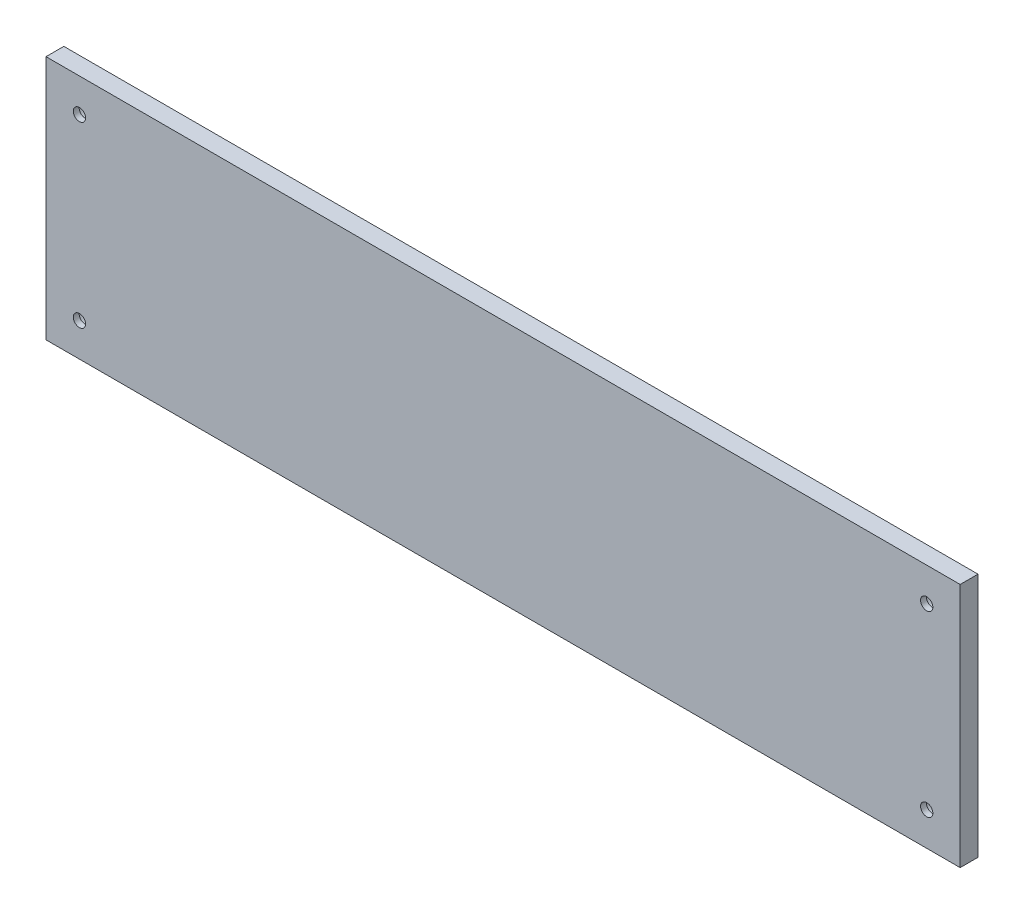
ISO-10303-21;
HEADER;
FILE_DESCRIPTION(('STEP AP214'),'2;1');
FILE_NAME('part.step','',(''),(''),'','','');
FILE_SCHEMA(('AUTOMOTIVE_DESIGN { 1 0 10303 214 1 1 1 1 }'));
ENDSEC;
DATA;
#1=APPLICATION_CONTEXT('core data for automotive mechanical design processes');
#2=APPLICATION_PROTOCOL_DEFINITION('international standard','automotive_design',2000,#1);
#3=PRODUCT_CONTEXT('',#1,'mechanical');
#4=PRODUCT('Part','Part','',(#3));
#5=PRODUCT_RELATED_PRODUCT_CATEGORY('part','',(#4));
#6=PRODUCT_DEFINITION_FORMATION('','',#4);
#7=PRODUCT_DEFINITION_CONTEXT('part definition',#1,'design');
#8=PRODUCT_DEFINITION('design','',#6,#7);
#9=PRODUCT_DEFINITION_SHAPE('','',#8);
#10=(LENGTH_UNIT() NAMED_UNIT(*) SI_UNIT(.MILLI.,.METRE.));
#11=(NAMED_UNIT(*) PLANE_ANGLE_UNIT() SI_UNIT($,.RADIAN.));
#12=(NAMED_UNIT(*) SI_UNIT($,.STERADIAN.) SOLID_ANGLE_UNIT());
#13=UNCERTAINTY_MEASURE_WITH_UNIT(LENGTH_MEASURE(1.E-05),#10,'distance_accuracy_value','');
#14=(GEOMETRIC_REPRESENTATION_CONTEXT(3) GLOBAL_UNCERTAINTY_ASSIGNED_CONTEXT((#13)) GLOBAL_UNIT_ASSIGNED_CONTEXT((#10,
#11,#12)) REPRESENTATION_CONTEXT('',''));
#15=CARTESIAN_POINT('',(0.,0.,0.));
#16=DIRECTION('',(0.,0.,1.));
#17=DIRECTION('',(1.,0.,0.));
#18=AXIS2_PLACEMENT_3D('',#15,#16,#17);
#19=CARTESIAN_POINT('',(0.,0.,8.));
#20=DIRECTION('',(1.,0.,0.));
#21=DIRECTION('',(0.,0.,-1.));
#22=AXIS2_PLACEMENT_3D('',#19,#20,#21);
#23=PLANE('',#22);
#24=DIRECTION('',(0.,-1.,0.));
#25=VECTOR('',#24,1.);
#26=CARTESIAN_POINT('',(0.,0.,0.));
#27=LINE('',#26,#25);
#28=CARTESIAN_POINT('',(0.,110.,0.));
#29=VERTEX_POINT('',#28);
#30=CARTESIAN_POINT('',(0.,0.,0.));
#31=VERTEX_POINT('',#30);
#32=EDGE_CURVE('E94',#29,#31,#27,.T.);
#33=ORIENTED_EDGE('',*,*,#32,.T.);
#34=DIRECTION('',(0.,0.,-1.));
#35=VECTOR('',#34,1.);
#36=CARTESIAN_POINT('',(0.,0.,8.));
#37=LINE('',#36,#35);
#38=CARTESIAN_POINT('',(0.,0.,8.));
#39=VERTEX_POINT('',#38);
#40=EDGE_CURVE('E11',#39,#31,#37,.T.);
#41=ORIENTED_EDGE('',*,*,#40,.F.);
#42=DIRECTION('',(0.,-1.,0.));
#43=VECTOR('',#42,1.);
#44=CARTESIAN_POINT('',(0.,0.,8.));
#45=LINE('',#44,#43);
#46=CARTESIAN_POINT('',(0.,110.,8.));
#47=VERTEX_POINT('',#46);
#48=EDGE_CURVE('E82',#47,#39,#45,.T.);
#49=ORIENTED_EDGE('',*,*,#48,.F.);
#50=DIRECTION('',(0.,0.,-1.));
#51=VECTOR('',#50,1.);
#52=CARTESIAN_POINT('',(0.,110.,8.));
#53=LINE('',#52,#51);
#54=EDGE_CURVE('E90',#47,#29,#53,.T.);
#55=ORIENTED_EDGE('',*,*,#54,.T.);
#56=EDGE_LOOP('',(#33,#41,#49,#55));
#57=FACE_BOUND('',#56,.T.);
#58=ADVANCED_FACE('F31',(#57),#23,.F.);
#59=CARTESIAN_POINT('',(0.,0.,8.));
#60=DIRECTION('',(0.,1.,0.));
#61=DIRECTION('',(0.,0.,1.));
#62=AXIS2_PLACEMENT_3D('',#59,#60,#61);
#63=PLANE('',#62);
#64=DIRECTION('',(1.,0.,0.));
#65=VECTOR('',#64,1.);
#66=CARTESIAN_POINT('',(0.,0.,0.));
#67=LINE('',#66,#65);
#68=CARTESIAN_POINT('',(410.,0.,0.));
#69=VERTEX_POINT('',#68);
#70=EDGE_CURVE('E86',#31,#69,#67,.T.);
#71=ORIENTED_EDGE('',*,*,#70,.T.);
#72=DIRECTION('',(0.,0.,-1.));
#73=VECTOR('',#72,1.);
#74=CARTESIAN_POINT('',(410.,0.,8.));
#75=LINE('',#74,#73);
#76=CARTESIAN_POINT('',(410.,0.,8.));
#77=VERTEX_POINT('',#76);
#78=EDGE_CURVE('E39',#77,#69,#75,.T.);
#79=ORIENTED_EDGE('',*,*,#78,.F.);
#80=DIRECTION('',(1.,0.,0.));
#81=VECTOR('',#80,1.);
#82=CARTESIAN_POINT('',(0.,0.,8.));
#83=LINE('',#82,#81);
#84=EDGE_CURVE('E77',#39,#77,#83,.T.);
#85=ORIENTED_EDGE('',*,*,#84,.F.);
#86=ORIENTED_EDGE('',*,*,#40,.T.);
#87=EDGE_LOOP('',(#71,#79,#85,#86));
#88=FACE_BOUND('',#87,.T.);
#89=ADVANCED_FACE('F85',(#88),#63,.F.);
#90=CARTESIAN_POINT('',(410.,0.,8.));
#91=DIRECTION('',(-1.,0.,0.));
#92=DIRECTION('',(0.,0.,1.));
#93=AXIS2_PLACEMENT_3D('',#90,#91,#92);
#94=PLANE('',#93);
#95=DIRECTION('',(0.,1.,0.));
#96=VECTOR('',#95,1.);
#97=CARTESIAN_POINT('',(410.,0.,0.));
#98=LINE('',#97,#96);
#99=CARTESIAN_POINT('',(410.,110.,0.));
#100=VERTEX_POINT('',#99);
#101=EDGE_CURVE('E64',#69,#100,#98,.T.);
#102=ORIENTED_EDGE('',*,*,#101,.T.);
#103=DIRECTION('',(0.,0.,-1.));
#104=VECTOR('',#103,1.);
#105=CARTESIAN_POINT('',(410.,110.,8.));
#106=LINE('',#105,#104);
#107=CARTESIAN_POINT('',(410.,110.,8.));
#108=VERTEX_POINT('',#107);
#109=EDGE_CURVE('E87',#108,#100,#106,.T.);
#110=ORIENTED_EDGE('',*,*,#109,.F.);
#111=DIRECTION('',(0.,1.,0.));
#112=VECTOR('',#111,1.);
#113=CARTESIAN_POINT('',(410.,0.,8.));
#114=LINE('',#113,#112);
#115=EDGE_CURVE('E80',#77,#108,#114,.T.);
#116=ORIENTED_EDGE('',*,*,#115,.F.);
#117=ORIENTED_EDGE('',*,*,#78,.T.);
#118=EDGE_LOOP('',(#102,#110,#116,#117));
#119=FACE_BOUND('',#118,.T.);
#120=ADVANCED_FACE('F88',(#119),#94,.F.);
#121=CARTESIAN_POINT('',(0.,110.,8.));
#122=DIRECTION('',(0.,-1.,0.));
#123=DIRECTION('',(0.,0.,-1.));
#124=AXIS2_PLACEMENT_3D('',#121,#122,#123);
#125=PLANE('',#124);
#126=DIRECTION('',(-1.,0.,0.));
#127=VECTOR('',#126,1.);
#128=CARTESIAN_POINT('',(0.,110.,0.));
#129=LINE('',#128,#127);
#130=EDGE_CURVE('E70',#100,#29,#129,.T.);
#131=ORIENTED_EDGE('',*,*,#130,.T.);
#132=ORIENTED_EDGE('',*,*,#54,.F.);
#133=DIRECTION('',(-1.,0.,0.));
#134=VECTOR('',#133,1.);
#135=CARTESIAN_POINT('',(0.,110.,8.));
#136=LINE('',#135,#134);
#137=EDGE_CURVE('E47',#108,#47,#136,.T.);
#138=ORIENTED_EDGE('',*,*,#137,.F.);
#139=ORIENTED_EDGE('',*,*,#109,.T.);
#140=EDGE_LOOP('',(#131,#132,#138,#139));
#141=FACE_BOUND('',#140,.T.);
#142=ADVANCED_FACE('F102',(#141),#125,.F.);
#143=CARTESIAN_POINT('',(0.,110.,8.));
#144=DIRECTION('',(0.,0.,-1.));
#145=DIRECTION('',(-1.,0.,0.));
#146=AXIS2_PLACEMENT_3D('',#143,#144,#145);
#147=PLANE('',#146);
#148=CARTESIAN_POINT('',(395.,95.,8.));
#149=DIRECTION('',(0.,0.,-1.));
#150=DIRECTION('',(-1.,0.,0.));
#151=AXIS2_PLACEMENT_3D('',#148,#149,#150);
#152=CIRCLE('',#151,2.74999999999997);
#153=CARTESIAN_POINT('',(392.25,95.,8.));
#154=VERTEX_POINT('',#153);
#155=EDGE_CURVE('E152',#154,#154,#152,.T.);
#156=ORIENTED_EDGE('',*,*,#155,.T.);
#157=EDGE_LOOP('',(#156));
#158=FACE_BOUND('',#157,.T.);
#159=CARTESIAN_POINT('',(15.,95.,8.));
#160=DIRECTION('',(0.,0.,-1.));
#161=DIRECTION('',(-1.,0.,0.));
#162=AXIS2_PLACEMENT_3D('',#159,#160,#161);
#163=CIRCLE('',#162,2.75);
#164=CARTESIAN_POINT('',(12.25,95.,8.));
#165=VERTEX_POINT('',#164);
#166=EDGE_CURVE('E140',#165,#165,#163,.T.);
#167=ORIENTED_EDGE('',*,*,#166,.T.);
#168=EDGE_LOOP('',(#167));
#169=FACE_BOUND('',#168,.T.);
#170=CARTESIAN_POINT('',(15.,15.,8.));
#171=DIRECTION('',(0.,0.,-1.));
#172=DIRECTION('',(-1.,0.,0.));
#173=AXIS2_PLACEMENT_3D('',#170,#171,#172);
#174=CIRCLE('',#173,2.75);
#175=CARTESIAN_POINT('',(12.25,15.,8.));
#176=VERTEX_POINT('',#175);
#177=EDGE_CURVE('E128',#176,#176,#174,.T.);
#178=ORIENTED_EDGE('',*,*,#177,.T.);
#179=EDGE_LOOP('',(#178));
#180=FACE_BOUND('',#179,.T.);
#181=CARTESIAN_POINT('',(395.,15.,8.));
#182=DIRECTION('',(0.,0.,-1.));
#183=DIRECTION('',(-1.,0.,0.));
#184=AXIS2_PLACEMENT_3D('',#181,#182,#183);
#185=CIRCLE('',#184,2.74999999999997);
#186=CARTESIAN_POINT('',(392.25,15.,8.));
#187=VERTEX_POINT('',#186);
#188=EDGE_CURVE('E116',#187,#187,#185,.T.);
#189=ORIENTED_EDGE('',*,*,#188,.T.);
#190=EDGE_LOOP('',(#189));
#191=FACE_BOUND('',#190,.T.);
#192=ORIENTED_EDGE('',*,*,#48,.T.);
#193=ORIENTED_EDGE('',*,*,#84,.T.);
#194=ORIENTED_EDGE('',*,*,#115,.T.);
#195=ORIENTED_EDGE('',*,*,#137,.T.);
#196=EDGE_LOOP('',(#192,#193,#194,#195));
#197=FACE_BOUND('',#196,.T.);
#198=ADVANCED_FACE('F78',(#158,#169,#180,#191,#197),#147,.F.);
#199=CARTESIAN_POINT('',(0.,110.,0.));
#200=DIRECTION('',(0.,0.,-1.));
#201=DIRECTION('',(-1.,0.,0.));
#202=AXIS2_PLACEMENT_3D('',#199,#200,#201);
#203=PLANE('',#202);
#204=CARTESIAN_POINT('',(395.,95.,0.));
#205=DIRECTION('',(0.,0.,-1.));
#206=DIRECTION('',(-1.,0.,0.));
#207=AXIS2_PLACEMENT_3D('',#204,#205,#206);
#208=CIRCLE('',#207,5.);
#209=CARTESIAN_POINT('',(390.,95.,0.));
#210=VERTEX_POINT('',#209);
#211=EDGE_CURVE('E143',#210,#210,#208,.T.);
#212=ORIENTED_EDGE('',*,*,#211,.F.);
#213=EDGE_LOOP('',(#212));
#214=FACE_BOUND('',#213,.T.);
#215=CARTESIAN_POINT('',(15.,95.,0.));
#216=DIRECTION('',(0.,0.,-1.));
#217=DIRECTION('',(-1.,0.,0.));
#218=AXIS2_PLACEMENT_3D('',#215,#216,#217);
#219=CIRCLE('',#218,4.99999999999999);
#220=CARTESIAN_POINT('',(9.99999999999997,95.,0.));
#221=VERTEX_POINT('',#220);
#222=EDGE_CURVE('E131',#221,#221,#219,.T.);
#223=ORIENTED_EDGE('',*,*,#222,.F.);
#224=EDGE_LOOP('',(#223));
#225=FACE_BOUND('',#224,.T.);
#226=CARTESIAN_POINT('',(15.,15.,0.));
#227=DIRECTION('',(0.,0.,-1.));
#228=DIRECTION('',(-1.,0.,0.));
#229=AXIS2_PLACEMENT_3D('',#226,#227,#228);
#230=CIRCLE('',#229,4.99999999999999);
#231=CARTESIAN_POINT('',(9.99999999999996,15.,0.));
#232=VERTEX_POINT('',#231);
#233=EDGE_CURVE('E119',#232,#232,#230,.T.);
#234=ORIENTED_EDGE('',*,*,#233,.F.);
#235=EDGE_LOOP('',(#234));
#236=FACE_BOUND('',#235,.T.);
#237=CARTESIAN_POINT('',(395.,15.,0.));
#238=DIRECTION('',(0.,0.,-1.));
#239=DIRECTION('',(-1.,0.,0.));
#240=AXIS2_PLACEMENT_3D('',#237,#238,#239);
#241=CIRCLE('',#240,5.);
#242=CARTESIAN_POINT('',(390.,15.,0.));
#243=VERTEX_POINT('',#242);
#244=EDGE_CURVE('E97',#243,#243,#241,.T.);
#245=ORIENTED_EDGE('',*,*,#244,.F.);
#246=EDGE_LOOP('',(#245));
#247=FACE_BOUND('',#246,.T.);
#248=ORIENTED_EDGE('',*,*,#32,.F.);
#249=ORIENTED_EDGE('',*,*,#130,.F.);
#250=ORIENTED_EDGE('',*,*,#101,.F.);
#251=ORIENTED_EDGE('',*,*,#70,.F.);
#252=EDGE_LOOP('',(#248,#249,#250,#251));
#253=FACE_BOUND('',#252,.T.);
#254=ADVANCED_FACE('F105',(#214,#225,#236,#247,#253),#203,.T.);
#255=CARTESIAN_POINT('',(395.,15.,0.));
#256=DIRECTION('',(0.,0.,-1.));
#257=DIRECTION('',(-1.,0.,0.));
#258=AXIS2_PLACEMENT_3D('',#255,#256,#257);
#259=CYLINDRICAL_SURFACE('',#258,5.);
#260=CARTESIAN_POINT('',(395.,15.,5.4));
#261=DIRECTION('',(0.,0.,-1.));
#262=DIRECTION('',(-1.,0.,0.));
#263=AXIS2_PLACEMENT_3D('',#260,#261,#262);
#264=CIRCLE('',#263,5.);
#265=CARTESIAN_POINT('',(390.,15.,5.4));
#266=VERTEX_POINT('',#265);
#267=EDGE_CURVE('E110',#266,#266,#264,.T.);
#268=ORIENTED_EDGE('',*,*,#267,.F.);
#269=EDGE_LOOP('',(#268));
#270=FACE_BOUND('',#269,.T.);
#271=ORIENTED_EDGE('',*,*,#244,.T.);
#272=EDGE_LOOP('',(#271));
#273=FACE_BOUND('',#272,.T.);
#274=ADVANCED_FACE('F179',(#270,#273),#259,.F.);
#275=CARTESIAN_POINT('',(397.75,15.,5.4));
#276=DIRECTION('',(0.,0.,1.));
#277=DIRECTION('',(1.,0.,0.));
#278=AXIS2_PLACEMENT_3D('',#275,#276,#277);
#279=PLANE('',#278);
#280=CARTESIAN_POINT('',(395.,15.,5.4));
#281=DIRECTION('',(0.,0.,-1.));
#282=DIRECTION('',(-1.,0.,0.));
#283=AXIS2_PLACEMENT_3D('',#280,#281,#282);
#284=CIRCLE('',#283,2.75000000000003);
#285=CARTESIAN_POINT('',(392.25,15.,5.4));
#286=VERTEX_POINT('',#285);
#287=EDGE_CURVE('E113',#286,#286,#284,.T.);
#288=ORIENTED_EDGE('',*,*,#287,.F.);
#289=EDGE_LOOP('',(#288));
#290=FACE_BOUND('',#289,.T.);
#291=ORIENTED_EDGE('',*,*,#267,.T.);
#292=EDGE_LOOP('',(#291));
#293=FACE_BOUND('',#292,.T.);
#294=ADVANCED_FACE('F188',(#290,#293),#279,.F.);
#295=CARTESIAN_POINT('',(395.,15.,0.));
#296=DIRECTION('',(0.,0.,-1.));
#297=DIRECTION('',(-1.,0.,0.));
#298=AXIS2_PLACEMENT_3D('',#295,#296,#297);
#299=CYLINDRICAL_SURFACE('',#298,2.75);
#300=ORIENTED_EDGE('',*,*,#188,.F.);
#301=EDGE_LOOP('',(#300));
#302=FACE_BOUND('',#301,.T.);
#303=ORIENTED_EDGE('',*,*,#287,.T.);
#304=EDGE_LOOP('',(#303));
#305=FACE_BOUND('',#304,.T.);
#306=ADVANCED_FACE('F194',(#302,#305),#299,.F.);
#307=CARTESIAN_POINT('',(15.,15.,0.));
#308=DIRECTION('',(0.,0.,-1.));
#309=DIRECTION('',(-1.,0.,0.));
#310=AXIS2_PLACEMENT_3D('',#307,#308,#309);
#311=CYLINDRICAL_SURFACE('',#310,4.99999999999999);
#312=CARTESIAN_POINT('',(15.,15.,5.4));
#313=DIRECTION('',(0.,0.,-1.));
#314=DIRECTION('',(-1.,0.,0.));
#315=AXIS2_PLACEMENT_3D('',#312,#313,#314);
#316=CIRCLE('',#315,4.99999999999999);
#317=CARTESIAN_POINT('',(9.99999999999996,15.,5.4));
#318=VERTEX_POINT('',#317);
#319=EDGE_CURVE('E122',#318,#318,#316,.T.);
#320=ORIENTED_EDGE('',*,*,#319,.F.);
#321=EDGE_LOOP('',(#320));
#322=FACE_BOUND('',#321,.T.);
#323=ORIENTED_EDGE('',*,*,#233,.T.);
#324=EDGE_LOOP('',(#323));
#325=FACE_BOUND('',#324,.T.);
#326=ADVANCED_FACE('F237',(#322,#325),#311,.F.);
#327=CARTESIAN_POINT('',(17.75,15.,5.4));
#328=DIRECTION('',(0.,0.,1.));
#329=DIRECTION('',(1.,0.,0.));
#330=AXIS2_PLACEMENT_3D('',#327,#328,#329);
#331=PLANE('',#330);
#332=CARTESIAN_POINT('',(15.,15.,5.4));
#333=DIRECTION('',(0.,0.,-1.));
#334=DIRECTION('',(-1.,0.,0.));
#335=AXIS2_PLACEMENT_3D('',#332,#333,#334);
#336=CIRCLE('',#335,2.75000000000001);
#337=CARTESIAN_POINT('',(12.2499999999999,15.,5.4));
#338=VERTEX_POINT('',#337);
#339=EDGE_CURVE('E125',#338,#338,#336,.T.);
#340=ORIENTED_EDGE('',*,*,#339,.F.);
#341=EDGE_LOOP('',(#340));
#342=FACE_BOUND('',#341,.T.);
#343=ORIENTED_EDGE('',*,*,#319,.T.);
#344=EDGE_LOOP('',(#343));
#345=FACE_BOUND('',#344,.T.);
#346=ADVANCED_FACE('F247',(#342,#345),#331,.F.);
#347=CARTESIAN_POINT('',(15.,15.,0.));
#348=DIRECTION('',(0.,0.,-1.));
#349=DIRECTION('',(-1.,0.,0.));
#350=AXIS2_PLACEMENT_3D('',#347,#348,#349);
#351=CYLINDRICAL_SURFACE('',#350,2.75);
#352=ORIENTED_EDGE('',*,*,#177,.F.);
#353=EDGE_LOOP('',(#352));
#354=FACE_BOUND('',#353,.T.);
#355=ORIENTED_EDGE('',*,*,#339,.T.);
#356=EDGE_LOOP('',(#355));
#357=FACE_BOUND('',#356,.T.);
#358=ADVANCED_FACE('F257',(#354,#357),#351,.F.);
#359=CARTESIAN_POINT('',(15.,95.,0.));
#360=DIRECTION('',(0.,0.,-1.));
#361=DIRECTION('',(-1.,0.,0.));
#362=AXIS2_PLACEMENT_3D('',#359,#360,#361);
#363=CYLINDRICAL_SURFACE('',#362,4.99999999999999);
#364=CARTESIAN_POINT('',(15.,95.,5.4));
#365=DIRECTION('',(0.,0.,-1.));
#366=DIRECTION('',(-1.,0.,0.));
#367=AXIS2_PLACEMENT_3D('',#364,#365,#366);
#368=CIRCLE('',#367,4.99999999999999);
#369=CARTESIAN_POINT('',(9.99999999999997,95.,5.4));
#370=VERTEX_POINT('',#369);
#371=EDGE_CURVE('E134',#370,#370,#368,.T.);
#372=ORIENTED_EDGE('',*,*,#371,.F.);
#373=EDGE_LOOP('',(#372));
#374=FACE_BOUND('',#373,.T.);
#375=ORIENTED_EDGE('',*,*,#222,.T.);
#376=EDGE_LOOP('',(#375));
#377=FACE_BOUND('',#376,.T.);
#378=ADVANCED_FACE('F267',(#374,#377),#363,.F.);
#379=CARTESIAN_POINT('',(17.75,95.,5.4));
#380=DIRECTION('',(0.,0.,1.));
#381=DIRECTION('',(1.,0.,0.));
#382=AXIS2_PLACEMENT_3D('',#379,#380,#381);
#383=PLANE('',#382);
#384=CARTESIAN_POINT('',(15.,95.,5.4));
#385=DIRECTION('',(0.,0.,-1.));
#386=DIRECTION('',(-1.,0.,0.));
#387=AXIS2_PLACEMENT_3D('',#384,#385,#386);
#388=CIRCLE('',#387,2.75000000000001);
#389=CARTESIAN_POINT('',(12.25,95.,5.4));
#390=VERTEX_POINT('',#389);
#391=EDGE_CURVE('E137',#390,#390,#388,.T.);
#392=ORIENTED_EDGE('',*,*,#391,.F.);
#393=EDGE_LOOP('',(#392));
#394=FACE_BOUND('',#393,.T.);
#395=ORIENTED_EDGE('',*,*,#371,.T.);
#396=EDGE_LOOP('',(#395));
#397=FACE_BOUND('',#396,.T.);
#398=ADVANCED_FACE('F277',(#394,#397),#383,.F.);
#399=CARTESIAN_POINT('',(15.,95.,0.));
#400=DIRECTION('',(0.,0.,-1.));
#401=DIRECTION('',(-1.,0.,0.));
#402=AXIS2_PLACEMENT_3D('',#399,#400,#401);
#403=CYLINDRICAL_SURFACE('',#402,2.75);
#404=ORIENTED_EDGE('',*,*,#166,.F.);
#405=EDGE_LOOP('',(#404));
#406=FACE_BOUND('',#405,.T.);
#407=ORIENTED_EDGE('',*,*,#391,.T.);
#408=EDGE_LOOP('',(#407));
#409=FACE_BOUND('',#408,.T.);
#410=ADVANCED_FACE('F173',(#406,#409),#403,.F.);
#411=CARTESIAN_POINT('',(395.,95.,0.));
#412=DIRECTION('',(0.,0.,-1.));
#413=DIRECTION('',(-1.,0.,0.));
#414=AXIS2_PLACEMENT_3D('',#411,#412,#413);
#415=CYLINDRICAL_SURFACE('',#414,5.);
#416=CARTESIAN_POINT('',(395.,95.,5.4));
#417=DIRECTION('',(0.,0.,-1.));
#418=DIRECTION('',(-1.,0.,0.));
#419=AXIS2_PLACEMENT_3D('',#416,#417,#418);
#420=CIRCLE('',#419,5.);
#421=CARTESIAN_POINT('',(390.,95.,5.4));
#422=VERTEX_POINT('',#421);
#423=EDGE_CURVE('E146',#422,#422,#420,.T.);
#424=ORIENTED_EDGE('',*,*,#423,.F.);
#425=EDGE_LOOP('',(#424));
#426=FACE_BOUND('',#425,.T.);
#427=ORIENTED_EDGE('',*,*,#211,.T.);
#428=EDGE_LOOP('',(#427));
#429=FACE_BOUND('',#428,.T.);
#430=ADVANCED_FACE('F167',(#426,#429),#415,.F.);
#431=CARTESIAN_POINT('',(397.75,95.,5.4));
#432=DIRECTION('',(0.,0.,1.));
#433=DIRECTION('',(1.,0.,0.));
#434=AXIS2_PLACEMENT_3D('',#431,#432,#433);
#435=PLANE('',#434);
#436=CARTESIAN_POINT('',(395.,95.,5.4));
#437=DIRECTION('',(0.,0.,-1.));
#438=DIRECTION('',(-1.,0.,0.));
#439=AXIS2_PLACEMENT_3D('',#436,#437,#438);
#440=CIRCLE('',#439,2.75000000000003);
#441=CARTESIAN_POINT('',(392.25,95.,5.4));
#442=VERTEX_POINT('',#441);
#443=EDGE_CURVE('E149',#442,#442,#440,.T.);
#444=ORIENTED_EDGE('',*,*,#443,.F.);
#445=EDGE_LOOP('',(#444));
#446=FACE_BOUND('',#445,.T.);
#447=ORIENTED_EDGE('',*,*,#423,.T.);
#448=EDGE_LOOP('',(#447));
#449=FACE_BOUND('',#448,.T.);
#450=ADVANCED_FACE('F161',(#446,#449),#435,.F.);
#451=CARTESIAN_POINT('',(395.,95.,0.));
#452=DIRECTION('',(0.,0.,-1.));
#453=DIRECTION('',(-1.,0.,0.));
#454=AXIS2_PLACEMENT_3D('',#451,#452,#453);
#455=CYLINDRICAL_SURFACE('',#454,2.75);
#456=ORIENTED_EDGE('',*,*,#155,.F.);
#457=EDGE_LOOP('',(#456));
#458=FACE_BOUND('',#457,.T.);
#459=ORIENTED_EDGE('',*,*,#443,.T.);
#460=EDGE_LOOP('',(#459));
#461=FACE_BOUND('',#460,.T.);
#462=ADVANCED_FACE('F158',(#458,#461),#455,.F.);
#463=CLOSED_SHELL('',(#58,#89,#120,#142,#198,#254,#274,#294,#306,#326,#346,#358,#378,#398,#410,
#430,#450,#462));
#464=MANIFOLD_SOLID_BREP('B2',#463);
#465=ADVANCED_BREP_SHAPE_REPRESENTATION('',(#18,#464),#14);
#466=SHAPE_DEFINITION_REPRESENTATION(#9,#465);
ENDSEC;
END-ISO-10303-21;
